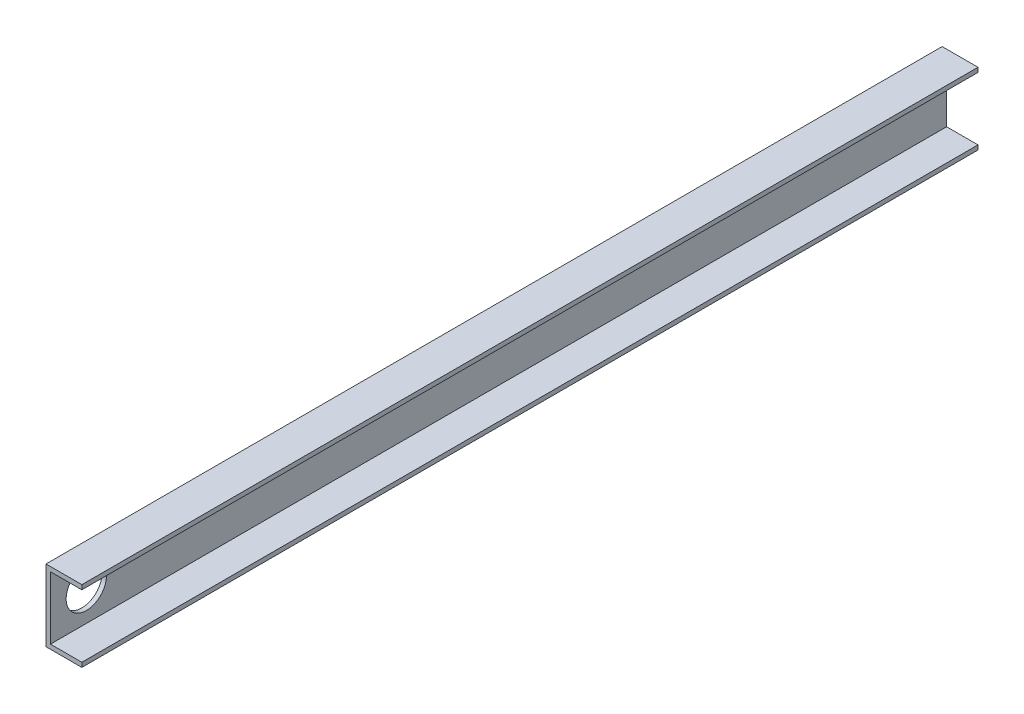
ISO-10303-21;
HEADER;
FILE_DESCRIPTION(('STEP AP214'),'2;1');
FILE_NAME('part.step','',(''),(''),'','','');
FILE_SCHEMA(('AUTOMOTIVE_DESIGN { 1 0 10303 214 1 1 1 1 }'));
ENDSEC;
DATA;
#1=APPLICATION_CONTEXT('core data for automotive mechanical design processes');
#2=APPLICATION_PROTOCOL_DEFINITION('international standard','automotive_design',2000,#1);
#3=PRODUCT_CONTEXT('',#1,'mechanical');
#4=PRODUCT('Part','Part','',(#3));
#5=PRODUCT_RELATED_PRODUCT_CATEGORY('part','',(#4));
#6=PRODUCT_DEFINITION_FORMATION('','',#4);
#7=PRODUCT_DEFINITION_CONTEXT('part definition',#1,'design');
#8=PRODUCT_DEFINITION('design','',#6,#7);
#9=PRODUCT_DEFINITION_SHAPE('','',#8);
#10=(LENGTH_UNIT() NAMED_UNIT(*) SI_UNIT(.MILLI.,.METRE.));
#11=(NAMED_UNIT(*) PLANE_ANGLE_UNIT() SI_UNIT($,.RADIAN.));
#12=(NAMED_UNIT(*) SI_UNIT($,.STERADIAN.) SOLID_ANGLE_UNIT());
#13=UNCERTAINTY_MEASURE_WITH_UNIT(LENGTH_MEASURE(1.E-05),#10,'distance_accuracy_value','');
#14=(GEOMETRIC_REPRESENTATION_CONTEXT(3) GLOBAL_UNCERTAINTY_ASSIGNED_CONTEXT((#13)) GLOBAL_UNIT_ASSIGNED_CONTEXT((#10,
#11,#12)) REPRESENTATION_CONTEXT('',''));
#15=CARTESIAN_POINT('',(0.,0.,0.));
#16=DIRECTION('',(0.,0.,1.));
#17=DIRECTION('',(1.,0.,0.));
#18=AXIS2_PLACEMENT_3D('',#15,#16,#17);
#19=CARTESIAN_POINT('',(25.4,0.,635.));
#20=DIRECTION('',(0.,1.,0.));
#21=DIRECTION('',(-1.,0.,0.));
#22=AXIS2_PLACEMENT_3D('',#19,#20,#21);
#23=PLANE('',#22);
#24=DIRECTION('',(1.,0.,0.));
#25=VECTOR('',#24,1.);
#26=CARTESIAN_POINT('',(25.4,0.,0.));
#27=LINE('',#26,#25);
#28=CARTESIAN_POINT('',(0.,0.,0.));
#29=VERTEX_POINT('',#28);
#30=CARTESIAN_POINT('',(25.4,0.,0.));
#31=VERTEX_POINT('',#30);
#32=EDGE_CURVE('E129',#29,#31,#27,.T.);
#33=ORIENTED_EDGE('',*,*,#32,.T.);
#34=DIRECTION('',(0.,0.,-1.));
#35=VECTOR('',#34,1.);
#36=CARTESIAN_POINT('',(25.4,0.,635.));
#37=LINE('',#36,#35);
#38=CARTESIAN_POINT('',(25.4,0.,635.));
#39=VERTEX_POINT('',#38);
#40=EDGE_CURVE('E11',#39,#31,#37,.T.);
#41=ORIENTED_EDGE('',*,*,#40,.F.);
#42=DIRECTION('',(1.,0.,0.));
#43=VECTOR('',#42,1.);
#44=CARTESIAN_POINT('',(25.4,0.,635.));
#45=LINE('',#44,#43);
#46=CARTESIAN_POINT('',(0.,0.,635.));
#47=VERTEX_POINT('',#46);
#48=EDGE_CURVE('E144',#47,#39,#45,.T.);
#49=ORIENTED_EDGE('',*,*,#48,.F.);
#50=DIRECTION('',(0.,0.,-1.));
#51=VECTOR('',#50,1.);
#52=CARTESIAN_POINT('',(0.,0.,635.));
#53=LINE('',#52,#51);
#54=EDGE_CURVE('E125',#47,#29,#53,.T.);
#55=ORIENTED_EDGE('',*,*,#54,.T.);
#56=EDGE_LOOP('',(#33,#41,#49,#55));
#57=FACE_BOUND('',#56,.T.);
#58=ADVANCED_FACE('F33',(#57),#23,.F.);
#59=CARTESIAN_POINT('',(25.4,3.175,635.));
#60=DIRECTION('',(-1.,0.,0.));
#61=DIRECTION('',(0.,0.,1.));
#62=AXIS2_PLACEMENT_3D('',#59,#60,#61);
#63=PLANE('',#62);
#64=DIRECTION('',(0.,1.,0.));
#65=VECTOR('',#64,1.);
#66=CARTESIAN_POINT('',(25.4,3.175,0.));
#67=LINE('',#66,#65);
#68=CARTESIAN_POINT('',(25.4,3.175,0.));
#69=VERTEX_POINT('',#68);
#70=EDGE_CURVE('E132',#31,#69,#67,.T.);
#71=ORIENTED_EDGE('',*,*,#70,.T.);
#72=DIRECTION('',(0.,0.,-1.));
#73=VECTOR('',#72,1.);
#74=CARTESIAN_POINT('',(25.4,3.175,635.));
#75=LINE('',#74,#73);
#76=CARTESIAN_POINT('',(25.4,3.175,635.));
#77=VERTEX_POINT('',#76);
#78=EDGE_CURVE('E41',#77,#69,#75,.T.);
#79=ORIENTED_EDGE('',*,*,#78,.F.);
#80=DIRECTION('',(0.,1.,0.));
#81=VECTOR('',#80,1.);
#82=CARTESIAN_POINT('',(25.4,3.175,635.));
#83=LINE('',#82,#81);
#84=EDGE_CURVE('E92',#39,#77,#83,.T.);
#85=ORIENTED_EDGE('',*,*,#84,.F.);
#86=ORIENTED_EDGE('',*,*,#40,.T.);
#87=EDGE_LOOP('',(#71,#79,#85,#86));
#88=FACE_BOUND('',#87,.T.);
#89=ADVANCED_FACE('F197',(#88),#63,.F.);
#90=CARTESIAN_POINT('',(3.17499999999999,3.175,635.));
#91=DIRECTION('',(0.,-1.,0.));
#92=DIRECTION('',(0.,0.,-1.));
#93=AXIS2_PLACEMENT_3D('',#90,#91,#92);
#94=PLANE('',#93);
#95=DIRECTION('',(-1.,0.,0.));
#96=VECTOR('',#95,1.);
#97=CARTESIAN_POINT('',(3.17499999999999,3.175,0.));
#98=LINE('',#97,#96);
#99=CARTESIAN_POINT('',(3.17499999999999,3.175,0.));
#100=VERTEX_POINT('',#99);
#101=EDGE_CURVE('E135',#69,#100,#98,.T.);
#102=ORIENTED_EDGE('',*,*,#101,.T.);
#103=DIRECTION('',(0.,0.,-1.));
#104=VECTOR('',#103,1.);
#105=CARTESIAN_POINT('',(3.17499999999999,3.175,635.));
#106=LINE('',#105,#104);
#107=CARTESIAN_POINT('',(3.17499999999999,3.175,635.));
#108=VERTEX_POINT('',#107);
#109=EDGE_CURVE('E151',#108,#100,#106,.T.);
#110=ORIENTED_EDGE('',*,*,#109,.F.);
#111=DIRECTION('',(-1.,0.,0.));
#112=VECTOR('',#111,1.);
#113=CARTESIAN_POINT('',(3.17499999999999,3.175,635.));
#114=LINE('',#113,#112);
#115=EDGE_CURVE('E159',#77,#108,#114,.T.);
#116=ORIENTED_EDGE('',*,*,#115,.F.);
#117=ORIENTED_EDGE('',*,*,#78,.T.);
#118=EDGE_LOOP('',(#102,#110,#116,#117));
#119=FACE_BOUND('',#118,.T.);
#120=ADVANCED_FACE('F157',(#119),#94,.F.);
#121=CARTESIAN_POINT('',(3.17499999999999,47.625,635.));
#122=DIRECTION('',(-1.,0.,0.));
#123=DIRECTION('',(0.,-1.,0.));
#124=AXIS2_PLACEMENT_3D('',#121,#122,#123);
#125=PLANE('',#124);
#126=CARTESIAN_POINT('',(3.17499999999999,25.4,609.6));
#127=DIRECTION('',(-1.,0.,0.));
#128=DIRECTION('',(0.,-1.,0.));
#129=AXIS2_PLACEMENT_3D('',#126,#127,#128);
#130=CIRCLE('',#129,14.2875);
#131=CARTESIAN_POINT('',(3.17499999999999,11.1125,609.6));
#132=VERTEX_POINT('',#131);
#133=EDGE_CURVE('E133',#132,#132,#130,.T.);
#134=ORIENTED_EDGE('',*,*,#133,.T.);
#135=EDGE_LOOP('',(#134));
#136=FACE_BOUND('',#135,.T.);
#137=DIRECTION('',(0.,1.,0.));
#138=VECTOR('',#137,1.);
#139=CARTESIAN_POINT('',(3.17499999999999,47.625,0.));
#140=LINE('',#139,#138);
#141=CARTESIAN_POINT('',(3.17499999999999,47.625,0.));
#142=VERTEX_POINT('',#141);
#143=EDGE_CURVE('E137',#100,#142,#140,.T.);
#144=ORIENTED_EDGE('',*,*,#143,.T.);
#145=DIRECTION('',(0.,0.,-1.));
#146=VECTOR('',#145,1.);
#147=CARTESIAN_POINT('',(3.17499999999999,47.625,635.));
#148=LINE('',#147,#146);
#149=CARTESIAN_POINT('',(3.17499999999999,47.625,635.));
#150=VERTEX_POINT('',#149);
#151=EDGE_CURVE('E148',#150,#142,#148,.T.);
#152=ORIENTED_EDGE('',*,*,#151,.F.);
#153=DIRECTION('',(0.,1.,0.));
#154=VECTOR('',#153,1.);
#155=CARTESIAN_POINT('',(3.17499999999999,47.625,635.));
#156=LINE('',#155,#154);
#157=EDGE_CURVE('E171',#108,#150,#156,.T.);
#158=ORIENTED_EDGE('',*,*,#157,.F.);
#159=ORIENTED_EDGE('',*,*,#109,.T.);
#160=EDGE_LOOP('',(#144,#152,#158,#159));
#161=FACE_BOUND('',#160,.T.);
#162=ADVANCED_FACE('F167',(#136,#161),#125,.F.);
#163=CARTESIAN_POINT('',(25.4,47.625,635.));
#164=DIRECTION('',(0.,1.,0.));
#165=DIRECTION('',(0.,0.,1.));
#166=AXIS2_PLACEMENT_3D('',#163,#164,#165);
#167=PLANE('',#166);
#168=DIRECTION('',(1.,0.,0.));
#169=VECTOR('',#168,1.);
#170=CARTESIAN_POINT('',(25.4,47.625,0.));
#171=LINE('',#170,#169);
#172=CARTESIAN_POINT('',(25.4,47.625,0.));
#173=VERTEX_POINT('',#172);
#174=EDGE_CURVE('E139',#142,#173,#171,.T.);
#175=ORIENTED_EDGE('',*,*,#174,.T.);
#176=DIRECTION('',(0.,0.,-1.));
#177=VECTOR('',#176,1.);
#178=CARTESIAN_POINT('',(25.4,47.625,635.));
#179=LINE('',#178,#177);
#180=CARTESIAN_POINT('',(25.4,47.625,635.));
#181=VERTEX_POINT('',#180);
#182=EDGE_CURVE('E120',#181,#173,#179,.T.);
#183=ORIENTED_EDGE('',*,*,#182,.F.);
#184=DIRECTION('',(1.,0.,0.));
#185=VECTOR('',#184,1.);
#186=CARTESIAN_POINT('',(25.4,47.625,635.));
#187=LINE('',#186,#185);
#188=EDGE_CURVE('E111',#150,#181,#187,.T.);
#189=ORIENTED_EDGE('',*,*,#188,.F.);
#190=ORIENTED_EDGE('',*,*,#151,.T.);
#191=EDGE_LOOP('',(#175,#183,#189,#190));
#192=FACE_BOUND('',#191,.T.);
#193=ADVANCED_FACE('F170',(#192),#167,.F.);
#194=CARTESIAN_POINT('',(25.4,50.8,635.));
#195=DIRECTION('',(-1.,0.,0.));
#196=DIRECTION('',(0.,0.,1.));
#197=AXIS2_PLACEMENT_3D('',#194,#195,#196);
#198=PLANE('',#197);
#199=DIRECTION('',(0.,1.,0.));
#200=VECTOR('',#199,1.);
#201=CARTESIAN_POINT('',(25.4,50.8,0.));
#202=LINE('',#201,#200);
#203=CARTESIAN_POINT('',(25.4,50.8,0.));
#204=VERTEX_POINT('',#203);
#205=EDGE_CURVE('E119',#173,#204,#202,.T.);
#206=ORIENTED_EDGE('',*,*,#205,.T.);
#207=DIRECTION('',(0.,0.,-1.));
#208=VECTOR('',#207,1.);
#209=CARTESIAN_POINT('',(25.4,50.8,635.));
#210=LINE('',#209,#208);
#211=CARTESIAN_POINT('',(25.4,50.8,635.));
#212=VERTEX_POINT('',#211);
#213=EDGE_CURVE('E116',#212,#204,#210,.T.);
#214=ORIENTED_EDGE('',*,*,#213,.F.);
#215=DIRECTION('',(0.,1.,0.));
#216=VECTOR('',#215,1.);
#217=CARTESIAN_POINT('',(25.4,50.8,635.));
#218=LINE('',#217,#216);
#219=EDGE_CURVE('E105',#181,#212,#218,.T.);
#220=ORIENTED_EDGE('',*,*,#219,.F.);
#221=ORIENTED_EDGE('',*,*,#182,.T.);
#222=EDGE_LOOP('',(#206,#214,#220,#221));
#223=FACE_BOUND('',#222,.T.);
#224=ADVANCED_FACE('F117',(#223),#198,.F.);
#225=CARTESIAN_POINT('',(0.,50.8,635.));
#226=DIRECTION('',(0.,-1.,0.));
#227=DIRECTION('',(0.,0.,-1.));
#228=AXIS2_PLACEMENT_3D('',#225,#226,#227);
#229=PLANE('',#228);
#230=DIRECTION('',(-1.,0.,0.));
#231=VECTOR('',#230,1.);
#232=CARTESIAN_POINT('',(0.,50.8,0.));
#233=LINE('',#232,#231);
#234=CARTESIAN_POINT('',(0.,50.8,0.));
#235=VERTEX_POINT('',#234);
#236=EDGE_CURVE('E78',#204,#235,#233,.T.);
#237=ORIENTED_EDGE('',*,*,#236,.T.);
#238=DIRECTION('',(0.,0.,-1.));
#239=VECTOR('',#238,1.);
#240=CARTESIAN_POINT('',(0.,50.8,635.));
#241=LINE('',#240,#239);
#242=CARTESIAN_POINT('',(0.,50.8,635.));
#243=VERTEX_POINT('',#242);
#244=EDGE_CURVE('E121',#243,#235,#241,.T.);
#245=ORIENTED_EDGE('',*,*,#244,.F.);
#246=DIRECTION('',(-1.,0.,0.));
#247=VECTOR('',#246,1.);
#248=CARTESIAN_POINT('',(0.,50.8,635.));
#249=LINE('',#248,#247);
#250=EDGE_CURVE('E109',#212,#243,#249,.T.);
#251=ORIENTED_EDGE('',*,*,#250,.F.);
#252=ORIENTED_EDGE('',*,*,#213,.T.);
#253=EDGE_LOOP('',(#237,#245,#251,#252));
#254=FACE_BOUND('',#253,.T.);
#255=ADVANCED_FACE('F123',(#254),#229,.F.);
#256=CARTESIAN_POINT('',(0.,0.,635.));
#257=DIRECTION('',(1.,0.,0.));
#258=DIRECTION('',(0.,1.,0.));
#259=AXIS2_PLACEMENT_3D('',#256,#257,#258);
#260=PLANE('',#259);
#261=CARTESIAN_POINT('',(0.,25.4,609.6));
#262=DIRECTION('',(-1.,0.,0.));
#263=DIRECTION('',(0.,-1.,0.));
#264=AXIS2_PLACEMENT_3D('',#261,#262,#263);
#265=CIRCLE('',#264,14.2875);
#266=CARTESIAN_POINT('',(0.,11.1125,609.6));
#267=VERTEX_POINT('',#266);
#268=EDGE_CURVE('E179',#267,#267,#265,.T.);
#269=ORIENTED_EDGE('',*,*,#268,.F.);
#270=EDGE_LOOP('',(#269));
#271=FACE_BOUND('',#270,.T.);
#272=DIRECTION('',(0.,-1.,0.));
#273=VECTOR('',#272,1.);
#274=CARTESIAN_POINT('',(0.,0.,0.));
#275=LINE('',#274,#273);
#276=EDGE_CURVE('E84',#235,#29,#275,.T.);
#277=ORIENTED_EDGE('',*,*,#276,.T.);
#278=ORIENTED_EDGE('',*,*,#54,.F.);
#279=DIRECTION('',(0.,-1.,0.));
#280=VECTOR('',#279,1.);
#281=CARTESIAN_POINT('',(0.,0.,635.));
#282=LINE('',#281,#280);
#283=EDGE_CURVE('E49',#243,#47,#282,.T.);
#284=ORIENTED_EDGE('',*,*,#283,.F.);
#285=ORIENTED_EDGE('',*,*,#244,.T.);
#286=EDGE_LOOP('',(#277,#278,#284,#285));
#287=FACE_BOUND('',#286,.T.);
#288=ADVANCED_FACE('F186',(#271,#287),#260,.F.);
#289=CARTESIAN_POINT('',(0.,0.,635.));
#290=DIRECTION('',(0.,0.,-1.));
#291=DIRECTION('',(-1.,0.,0.));
#292=AXIS2_PLACEMENT_3D('',#289,#290,#291);
#293=PLANE('',#292);
#294=ORIENTED_EDGE('',*,*,#48,.T.);
#295=ORIENTED_EDGE('',*,*,#84,.T.);
#296=ORIENTED_EDGE('',*,*,#115,.T.);
#297=ORIENTED_EDGE('',*,*,#157,.T.);
#298=ORIENTED_EDGE('',*,*,#188,.T.);
#299=ORIENTED_EDGE('',*,*,#219,.T.);
#300=ORIENTED_EDGE('',*,*,#250,.T.);
#301=ORIENTED_EDGE('',*,*,#283,.T.);
#302=EDGE_LOOP('',(#294,#295,#296,#297,#298,#299,#300,#301));
#303=FACE_BOUND('',#302,.T.);
#304=ADVANCED_FACE('F107',(#303),#293,.F.);
#305=CARTESIAN_POINT('',(0.,0.,0.));
#306=DIRECTION('',(0.,0.,-1.));
#307=DIRECTION('',(-1.,0.,0.));
#308=AXIS2_PLACEMENT_3D('',#305,#306,#307);
#309=PLANE('',#308);
#310=ORIENTED_EDGE('',*,*,#32,.F.);
#311=ORIENTED_EDGE('',*,*,#276,.F.);
#312=ORIENTED_EDGE('',*,*,#236,.F.);
#313=ORIENTED_EDGE('',*,*,#205,.F.);
#314=ORIENTED_EDGE('',*,*,#174,.F.);
#315=ORIENTED_EDGE('',*,*,#143,.F.);
#316=ORIENTED_EDGE('',*,*,#101,.F.);
#317=ORIENTED_EDGE('',*,*,#70,.F.);
#318=EDGE_LOOP('',(#310,#311,#312,#313,#314,#315,#316,#317));
#319=FACE_BOUND('',#318,.T.);
#320=ADVANCED_FACE('F163',(#319),#309,.T.);
#321=CARTESIAN_POINT('',(25.4,25.4,609.6));
#322=DIRECTION('',(-1.,0.,0.));
#323=DIRECTION('',(0.,-1.,0.));
#324=AXIS2_PLACEMENT_3D('',#321,#322,#323);
#325=CYLINDRICAL_SURFACE('',#324,14.2875);
#326=ORIENTED_EDGE('',*,*,#268,.T.);
#327=EDGE_LOOP('',(#326));
#328=FACE_BOUND('',#327,.T.);
#329=ORIENTED_EDGE('',*,*,#133,.F.);
#330=EDGE_LOOP('',(#329));
#331=FACE_BOUND('',#330,.T.);
#332=ADVANCED_FACE('F183',(#328,#331),#325,.F.);
#333=CLOSED_SHELL('',(#58,#89,#120,#162,#193,#224,#255,#288,#304,#320,#332));
#334=MANIFOLD_SOLID_BREP('B2',#333);
#335=ADVANCED_BREP_SHAPE_REPRESENTATION('',(#18,#334),#14);
#336=SHAPE_DEFINITION_REPRESENTATION(#9,#335);
ENDSEC;
END-ISO-10303-21;
